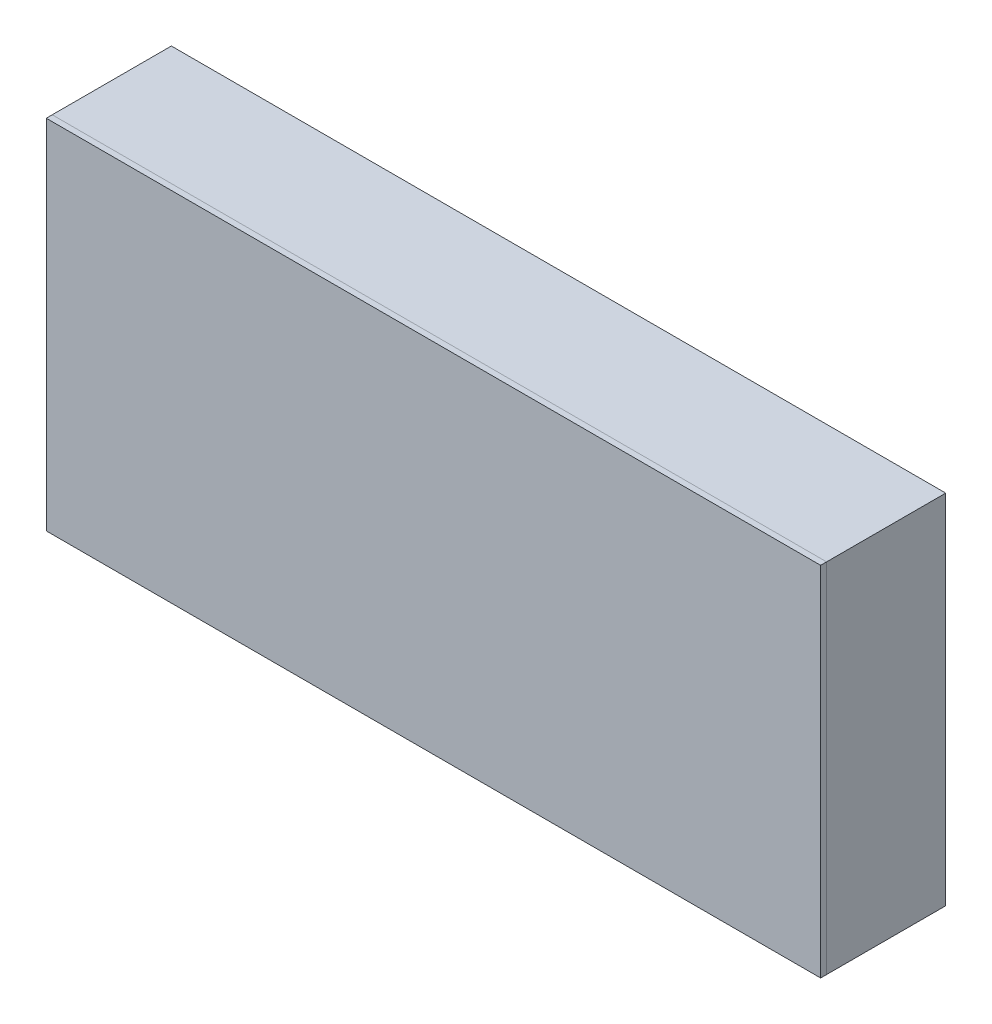
ISO-10303-21;
HEADER;
FILE_DESCRIPTION(('STEP AP214'),'2;1');
FILE_NAME('part.step','',(''),(''),'','','');
FILE_SCHEMA(('AUTOMOTIVE_DESIGN { 1 0 10303 214 1 1 1 1 }'));
ENDSEC;
DATA;
#1=APPLICATION_CONTEXT('core data for automotive mechanical design processes');
#2=APPLICATION_PROTOCOL_DEFINITION('international standard','automotive_design',2000,#1);
#3=PRODUCT_CONTEXT('',#1,'mechanical');
#4=PRODUCT('Part','Part','',(#3));
#5=PRODUCT_RELATED_PRODUCT_CATEGORY('part','',(#4));
#6=PRODUCT_DEFINITION_FORMATION('','',#4);
#7=PRODUCT_DEFINITION_CONTEXT('part definition',#1,'design');
#8=PRODUCT_DEFINITION('design','',#6,#7);
#9=PRODUCT_DEFINITION_SHAPE('','',#8);
#10=(LENGTH_UNIT() NAMED_UNIT(*) SI_UNIT(.MILLI.,.METRE.));
#11=(NAMED_UNIT(*) PLANE_ANGLE_UNIT() SI_UNIT($,.RADIAN.));
#12=(NAMED_UNIT(*) SI_UNIT($,.STERADIAN.) SOLID_ANGLE_UNIT());
#13=UNCERTAINTY_MEASURE_WITH_UNIT(LENGTH_MEASURE(1.E-05),#10,'distance_accuracy_value','');
#14=(GEOMETRIC_REPRESENTATION_CONTEXT(3) GLOBAL_UNCERTAINTY_ASSIGNED_CONTEXT((#13)) GLOBAL_UNIT_ASSIGNED_CONTEXT((#10,
#11,#12)) REPRESENTATION_CONTEXT('',''));
#15=CARTESIAN_POINT('',(0.,0.,0.));
#16=DIRECTION('',(0.,0.,1.));
#17=DIRECTION('',(1.,0.,0.));
#18=AXIS2_PLACEMENT_3D('',#15,#16,#17);
#19=CARTESIAN_POINT('',(0.,0.,20.));
#20=DIRECTION('',(0.,0.,1.));
#21=DIRECTION('',(1.,0.,0.));
#22=AXIS2_PLACEMENT_3D('',#19,#20,#21);
#23=PLANE('',#22);
#24=DIRECTION('',(0.,1.,0.));
#25=VECTOR('',#24,1.);
#26=CARTESIAN_POINT('',(65.,0.,20.));
#27=LINE('',#26,#25);
#28=CARTESIAN_POINT('',(65.,-30.,20.));
#29=VERTEX_POINT('',#28);
#30=CARTESIAN_POINT('',(65.,30.,20.));
#31=VERTEX_POINT('',#30);
#32=EDGE_CURVE('E230',#29,#31,#27,.T.);
#33=ORIENTED_EDGE('',*,*,#32,.F.);
#34=DIRECTION('',(1.,0.,0.));
#35=VECTOR('',#34,1.);
#36=CARTESIAN_POINT('',(0.,-30.,20.));
#37=LINE('',#36,#35);
#38=CARTESIAN_POINT('',(-65.,-30.,20.));
#39=VERTEX_POINT('',#38);
#40=EDGE_CURVE('E235',#39,#29,#37,.T.);
#41=ORIENTED_EDGE('',*,*,#40,.F.);
#42=DIRECTION('',(0.,-1.,0.));
#43=VECTOR('',#42,1.);
#44=CARTESIAN_POINT('',(-65.,0.,20.));
#45=LINE('',#44,#43);
#46=CARTESIAN_POINT('',(-65.,30.,20.));
#47=VERTEX_POINT('',#46);
#48=EDGE_CURVE('E246',#47,#39,#45,.T.);
#49=ORIENTED_EDGE('',*,*,#48,.F.);
#50=DIRECTION('',(-1.,0.,0.));
#51=VECTOR('',#50,1.);
#52=CARTESIAN_POINT('',(0.,30.,20.));
#53=LINE('',#52,#51);
#54=EDGE_CURVE('E244',#31,#47,#53,.T.);
#55=ORIENTED_EDGE('',*,*,#54,.F.);
#56=EDGE_LOOP('',(#33,#41,#49,#55));
#57=FACE_BOUND('',#56,.T.);
#58=DIRECTION('',(1.,0.,0.));
#59=VECTOR('',#58,1.);
#60=CARTESIAN_POINT('',(-62.75,27.75,20.));
#61=LINE('',#60,#59);
#62=CARTESIAN_POINT('',(-62.75,27.75,20.));
#63=VERTEX_POINT('',#62);
#64=CARTESIAN_POINT('',(62.75,27.75,20.));
#65=VERTEX_POINT('',#64);
#66=EDGE_CURVE('E179',#63,#65,#61,.T.);
#67=ORIENTED_EDGE('',*,*,#66,.F.);
#68=DIRECTION('',(0.,1.,0.));
#69=VECTOR('',#68,1.);
#70=CARTESIAN_POINT('',(-62.75,-27.75,20.));
#71=LINE('',#70,#69);
#72=CARTESIAN_POINT('',(-62.75,-27.75,20.));
#73=VERTEX_POINT('',#72);
#74=EDGE_CURVE('E207',#73,#63,#71,.T.);
#75=ORIENTED_EDGE('',*,*,#74,.F.);
#76=DIRECTION('',(-1.,0.,0.));
#77=VECTOR('',#76,1.);
#78=CARTESIAN_POINT('',(62.75,-27.75,20.));
#79=LINE('',#78,#77);
#80=CARTESIAN_POINT('',(62.75,-27.75,20.));
#81=VERTEX_POINT('',#80);
#82=EDGE_CURVE('E93',#81,#73,#79,.T.);
#83=ORIENTED_EDGE('',*,*,#82,.F.);
#84=DIRECTION('',(0.,-1.,0.));
#85=VECTOR('',#84,1.);
#86=CARTESIAN_POINT('',(62.75,27.75,20.));
#87=LINE('',#86,#85);
#88=EDGE_CURVE('E88',#65,#81,#87,.T.);
#89=ORIENTED_EDGE('',*,*,#88,.F.);
#90=EDGE_LOOP('',(#67,#75,#83,#89));
#91=FACE_BOUND('',#90,.T.);
#92=ADVANCED_FACE('F73',(#57,#91),#23,.F.);
#93=CARTESIAN_POINT('',(65.,0.,21.));
#94=DIRECTION('',(-1.,0.,0.));
#95=DIRECTION('',(0.,0.,1.));
#96=AXIS2_PLACEMENT_3D('',#93,#94,#95);
#97=PLANE('',#96);
#98=ORIENTED_EDGE('',*,*,#32,.T.);
#99=DIRECTION('',(0.,0.,-1.));
#100=VECTOR('',#99,1.);
#101=CARTESIAN_POINT('',(65.,30.,21.));
#102=LINE('',#101,#100);
#103=CARTESIAN_POINT('',(65.,30.,21.));
#104=VERTEX_POINT('',#103);
#105=EDGE_CURVE('E13',#104,#31,#102,.T.);
#106=ORIENTED_EDGE('',*,*,#105,.F.);
#107=DIRECTION('',(0.,1.,0.));
#108=VECTOR('',#107,1.);
#109=CARTESIAN_POINT('',(65.,0.,21.));
#110=LINE('',#109,#108);
#111=CARTESIAN_POINT('',(65.,-30.,21.));
#112=VERTEX_POINT('',#111);
#113=EDGE_CURVE('E231',#112,#104,#110,.T.);
#114=ORIENTED_EDGE('',*,*,#113,.F.);
#115=DIRECTION('',(0.,0.,-1.));
#116=VECTOR('',#115,1.);
#117=CARTESIAN_POINT('',(65.,-30.,21.));
#118=LINE('',#117,#116);
#119=EDGE_CURVE('E241',#112,#29,#118,.T.);
#120=ORIENTED_EDGE('',*,*,#119,.T.);
#121=EDGE_LOOP('',(#98,#106,#114,#120));
#122=FACE_BOUND('',#121,.T.);
#123=ADVANCED_FACE('F75',(#122),#97,.F.);
#124=CARTESIAN_POINT('',(0.,30.,21.));
#125=DIRECTION('',(0.,-1.,0.));
#126=DIRECTION('',(1.,0.,0.));
#127=AXIS2_PLACEMENT_3D('',#124,#125,#126);
#128=PLANE('',#127);
#129=ORIENTED_EDGE('',*,*,#54,.T.);
#130=DIRECTION('',(0.,0.,-1.));
#131=VECTOR('',#130,1.);
#132=CARTESIAN_POINT('',(-65.,30.,21.));
#133=LINE('',#132,#131);
#134=CARTESIAN_POINT('',(-65.,30.,21.));
#135=VERTEX_POINT('',#134);
#136=EDGE_CURVE('E81',#135,#47,#133,.T.);
#137=ORIENTED_EDGE('',*,*,#136,.F.);
#138=DIRECTION('',(-1.,0.,0.));
#139=VECTOR('',#138,1.);
#140=CARTESIAN_POINT('',(0.,30.,21.));
#141=LINE('',#140,#139);
#142=EDGE_CURVE('E234',#104,#135,#141,.T.);
#143=ORIENTED_EDGE('',*,*,#142,.F.);
#144=ORIENTED_EDGE('',*,*,#105,.T.);
#145=EDGE_LOOP('',(#129,#137,#143,#144));
#146=FACE_BOUND('',#145,.T.);
#147=ADVANCED_FACE('F273',(#146),#128,.F.);
#148=CARTESIAN_POINT('',(-65.,0.,21.));
#149=DIRECTION('',(1.,0.,0.));
#150=DIRECTION('',(0.,0.,-1.));
#151=AXIS2_PLACEMENT_3D('',#148,#149,#150);
#152=PLANE('',#151);
#153=ORIENTED_EDGE('',*,*,#48,.T.);
#154=DIRECTION('',(0.,0.,-1.));
#155=VECTOR('',#154,1.);
#156=CARTESIAN_POINT('',(-65.,-30.,21.));
#157=LINE('',#156,#155);
#158=CARTESIAN_POINT('',(-65.,-30.,21.));
#159=VERTEX_POINT('',#158);
#160=EDGE_CURVE('E251',#159,#39,#157,.T.);
#161=ORIENTED_EDGE('',*,*,#160,.F.);
#162=DIRECTION('',(0.,-1.,0.));
#163=VECTOR('',#162,1.);
#164=CARTESIAN_POINT('',(-65.,0.,21.));
#165=LINE('',#164,#163);
#166=EDGE_CURVE('E237',#135,#159,#165,.T.);
#167=ORIENTED_EDGE('',*,*,#166,.F.);
#168=ORIENTED_EDGE('',*,*,#136,.T.);
#169=EDGE_LOOP('',(#153,#161,#167,#168));
#170=FACE_BOUND('',#169,.T.);
#171=ADVANCED_FACE('F258',(#170),#152,.F.);
#172=CARTESIAN_POINT('',(0.,-30.,21.));
#173=DIRECTION('',(0.,1.,0.));
#174=DIRECTION('',(-1.,0.,0.));
#175=AXIS2_PLACEMENT_3D('',#172,#173,#174);
#176=PLANE('',#175);
#177=ORIENTED_EDGE('',*,*,#40,.T.);
#178=ORIENTED_EDGE('',*,*,#119,.F.);
#179=DIRECTION('',(1.,0.,0.));
#180=VECTOR('',#179,1.);
#181=CARTESIAN_POINT('',(0.,-30.,21.));
#182=LINE('',#181,#180);
#183=EDGE_CURVE('E239',#159,#112,#182,.T.);
#184=ORIENTED_EDGE('',*,*,#183,.F.);
#185=ORIENTED_EDGE('',*,*,#160,.T.);
#186=EDGE_LOOP('',(#177,#178,#184,#185));
#187=FACE_BOUND('',#186,.T.);
#188=ADVANCED_FACE('F266',(#187),#176,.F.);
#189=CARTESIAN_POINT('',(0.,0.,21.));
#190=DIRECTION('',(0.,0.,1.));
#191=DIRECTION('',(1.,0.,0.));
#192=AXIS2_PLACEMENT_3D('',#189,#190,#191);
#193=PLANE('',#192);
#194=ORIENTED_EDGE('',*,*,#113,.T.);
#195=ORIENTED_EDGE('',*,*,#142,.T.);
#196=ORIENTED_EDGE('',*,*,#166,.T.);
#197=ORIENTED_EDGE('',*,*,#183,.T.);
#198=EDGE_LOOP('',(#194,#195,#196,#197));
#199=FACE_BOUND('',#198,.T.);
#200=ADVANCED_FACE('F272',(#199),#193,.T.);
#201=CARTESIAN_POINT('',(0.,0.,15.));
#202=DIRECTION('',(0.,0.,-1.));
#203=DIRECTION('',(-1.,0.,0.));
#204=AXIS2_PLACEMENT_3D('',#201,#202,#203);
#205=PLANE('',#204);
#206=DIRECTION('',(1.,0.,0.));
#207=VECTOR('',#206,1.);
#208=CARTESIAN_POINT('',(-62.75,27.75,15.));
#209=LINE('',#208,#207);
#210=CARTESIAN_POINT('',(-62.75,27.75,15.));
#211=VERTEX_POINT('',#210);
#212=CARTESIAN_POINT('',(62.75,27.75,15.));
#213=VERTEX_POINT('',#212);
#214=EDGE_CURVE('E203',#211,#213,#209,.T.);
#215=ORIENTED_EDGE('',*,*,#214,.T.);
#216=DIRECTION('',(0.,-1.,0.));
#217=VECTOR('',#216,1.);
#218=CARTESIAN_POINT('',(62.75,27.75,15.));
#219=LINE('',#218,#217);
#220=CARTESIAN_POINT('',(62.75,-27.75,15.));
#221=VERTEX_POINT('',#220);
#222=EDGE_CURVE('E206',#213,#221,#219,.T.);
#223=ORIENTED_EDGE('',*,*,#222,.T.);
#224=DIRECTION('',(-1.,0.,0.));
#225=VECTOR('',#224,1.);
#226=CARTESIAN_POINT('',(62.75,-27.75,15.));
#227=LINE('',#226,#225);
#228=CARTESIAN_POINT('',(-62.75,-27.75,15.));
#229=VERTEX_POINT('',#228);
#230=EDGE_CURVE('E209',#221,#229,#227,.T.);
#231=ORIENTED_EDGE('',*,*,#230,.T.);
#232=DIRECTION('',(0.,1.,0.));
#233=VECTOR('',#232,1.);
#234=CARTESIAN_POINT('',(-62.75,-27.75,15.));
#235=LINE('',#234,#233);
#236=EDGE_CURVE('E211',#229,#211,#235,.T.);
#237=ORIENTED_EDGE('',*,*,#236,.T.);
#238=EDGE_LOOP('',(#215,#223,#231,#237));
#239=FACE_BOUND('',#238,.T.);
#240=DIRECTION('',(0.,-1.,0.));
#241=VECTOR('',#240,1.);
#242=CARTESIAN_POINT('',(60.75,0.,15.));
#243=LINE('',#242,#241);
#244=CARTESIAN_POINT('',(60.75,25.75,15.));
#245=VERTEX_POINT('',#244);
#246=CARTESIAN_POINT('',(60.75,-25.75,15.));
#247=VERTEX_POINT('',#246);
#248=EDGE_CURVE('E171',#245,#247,#243,.T.);
#249=ORIENTED_EDGE('',*,*,#248,.F.);
#250=DIRECTION('',(1.,0.,0.));
#251=VECTOR('',#250,1.);
#252=CARTESIAN_POINT('',(0.,25.75,15.));
#253=LINE('',#252,#251);
#254=CARTESIAN_POINT('',(-60.75,25.75,15.));
#255=VERTEX_POINT('',#254);
#256=EDGE_CURVE('E161',#255,#245,#253,.T.);
#257=ORIENTED_EDGE('',*,*,#256,.F.);
#258=DIRECTION('',(0.,1.,0.));
#259=VECTOR('',#258,1.);
#260=CARTESIAN_POINT('',(-60.75,0.,15.));
#261=LINE('',#260,#259);
#262=CARTESIAN_POINT('',(-60.75,-25.75,15.));
#263=VERTEX_POINT('',#262);
#264=EDGE_CURVE('E187',#263,#255,#261,.T.);
#265=ORIENTED_EDGE('',*,*,#264,.F.);
#266=DIRECTION('',(-1.,0.,0.));
#267=VECTOR('',#266,1.);
#268=CARTESIAN_POINT('',(0.,-25.75,15.));
#269=LINE('',#268,#267);
#270=EDGE_CURVE('E185',#247,#263,#269,.T.);
#271=ORIENTED_EDGE('',*,*,#270,.F.);
#272=EDGE_LOOP('',(#249,#257,#265,#271));
#273=FACE_BOUND('',#272,.T.);
#274=ADVANCED_FACE('F183',(#239,#273),#205,.T.);
#275=CARTESIAN_POINT('',(-62.75,27.75,15.));
#276=DIRECTION('',(0.,-1.,0.));
#277=DIRECTION('',(1.,0.,0.));
#278=AXIS2_PLACEMENT_3D('',#275,#276,#277);
#279=PLANE('',#278);
#280=ORIENTED_EDGE('',*,*,#66,.T.);
#281=DIRECTION('',(0.,0.,1.));
#282=VECTOR('',#281,1.);
#283=CARTESIAN_POINT('',(62.75,27.75,15.));
#284=LINE('',#283,#282);
#285=EDGE_CURVE('E228',#213,#65,#284,.T.);
#286=ORIENTED_EDGE('',*,*,#285,.F.);
#287=ORIENTED_EDGE('',*,*,#214,.F.);
#288=DIRECTION('',(0.,0.,1.));
#289=VECTOR('',#288,1.);
#290=CARTESIAN_POINT('',(-62.75,27.75,15.));
#291=LINE('',#290,#289);
#292=EDGE_CURVE('E213',#211,#63,#291,.T.);
#293=ORIENTED_EDGE('',*,*,#292,.T.);
#294=EDGE_LOOP('',(#280,#286,#287,#293));
#295=FACE_BOUND('',#294,.T.);
#296=ADVANCED_FACE('F311',(#295),#279,.F.);
#297=CARTESIAN_POINT('',(62.75,27.75,15.));
#298=DIRECTION('',(-1.,0.,0.));
#299=DIRECTION('',(0.,0.,1.));
#300=AXIS2_PLACEMENT_3D('',#297,#298,#299);
#301=PLANE('',#300);
#302=ORIENTED_EDGE('',*,*,#88,.T.);
#303=DIRECTION('',(0.,0.,1.));
#304=VECTOR('',#303,1.);
#305=CARTESIAN_POINT('',(62.75,-27.75,15.));
#306=LINE('',#305,#304);
#307=EDGE_CURVE('E225',#221,#81,#306,.T.);
#308=ORIENTED_EDGE('',*,*,#307,.F.);
#309=ORIENTED_EDGE('',*,*,#222,.F.);
#310=ORIENTED_EDGE('',*,*,#285,.T.);
#311=EDGE_LOOP('',(#302,#308,#309,#310));
#312=FACE_BOUND('',#311,.T.);
#313=ADVANCED_FACE('F319',(#312),#301,.F.);
#314=CARTESIAN_POINT('',(62.75,-27.75,15.));
#315=DIRECTION('',(0.,1.,0.));
#316=DIRECTION('',(-1.,0.,0.));
#317=AXIS2_PLACEMENT_3D('',#314,#315,#316);
#318=PLANE('',#317);
#319=ORIENTED_EDGE('',*,*,#82,.T.);
#320=DIRECTION('',(0.,0.,1.));
#321=VECTOR('',#320,1.);
#322=CARTESIAN_POINT('',(-62.75,-27.75,15.));
#323=LINE('',#322,#321);
#324=EDGE_CURVE('E222',#229,#73,#323,.T.);
#325=ORIENTED_EDGE('',*,*,#324,.F.);
#326=ORIENTED_EDGE('',*,*,#230,.F.);
#327=ORIENTED_EDGE('',*,*,#307,.T.);
#328=EDGE_LOOP('',(#319,#325,#326,#327));
#329=FACE_BOUND('',#328,.T.);
#330=ADVANCED_FACE('F315',(#329),#318,.F.);
#331=CARTESIAN_POINT('',(-62.75,-27.75,15.));
#332=DIRECTION('',(1.,0.,0.));
#333=DIRECTION('',(0.,0.,-1.));
#334=AXIS2_PLACEMENT_3D('',#331,#332,#333);
#335=PLANE('',#334);
#336=ORIENTED_EDGE('',*,*,#74,.T.);
#337=ORIENTED_EDGE('',*,*,#292,.F.);
#338=ORIENTED_EDGE('',*,*,#236,.F.);
#339=ORIENTED_EDGE('',*,*,#324,.T.);
#340=EDGE_LOOP('',(#336,#337,#338,#339));
#341=FACE_BOUND('',#340,.T.);
#342=ADVANCED_FACE('F308',(#341),#335,.F.);
#343=CARTESIAN_POINT('',(0.,25.75,15.));
#344=DIRECTION('',(0.,-1.,0.));
#345=DIRECTION('',(1.,0.,0.));
#346=AXIS2_PLACEMENT_3D('',#343,#344,#345);
#347=PLANE('',#346);
#348=DIRECTION('',(1.,0.,0.));
#349=VECTOR('',#348,1.);
#350=CARTESIAN_POINT('',(0.,25.75,20.));
#351=LINE('',#350,#349);
#352=CARTESIAN_POINT('',(-60.75,25.75,20.));
#353=VERTEX_POINT('',#352);
#354=CARTESIAN_POINT('',(60.75,25.75,20.));
#355=VERTEX_POINT('',#354);
#356=EDGE_CURVE('E191',#353,#355,#351,.T.);
#357=ORIENTED_EDGE('',*,*,#356,.F.);
#358=DIRECTION('',(0.,0.,1.));
#359=VECTOR('',#358,1.);
#360=CARTESIAN_POINT('',(-60.75,25.75,15.));
#361=LINE('',#360,#359);
#362=EDGE_CURVE('E167',#255,#353,#361,.T.);
#363=ORIENTED_EDGE('',*,*,#362,.F.);
#364=ORIENTED_EDGE('',*,*,#256,.T.);
#365=DIRECTION('',(0.,0.,1.));
#366=VECTOR('',#365,1.);
#367=CARTESIAN_POINT('',(60.75,25.75,15.));
#368=LINE('',#367,#366);
#369=EDGE_CURVE('E165',#245,#355,#368,.T.);
#370=ORIENTED_EDGE('',*,*,#369,.T.);
#371=EDGE_LOOP('',(#357,#363,#364,#370));
#372=FACE_BOUND('',#371,.T.);
#373=ADVANCED_FACE('F164',(#372),#347,.T.);
#374=CARTESIAN_POINT('',(60.75,0.,15.));
#375=DIRECTION('',(-1.,0.,0.));
#376=DIRECTION('',(0.,0.,1.));
#377=AXIS2_PLACEMENT_3D('',#374,#375,#376);
#378=PLANE('',#377);
#379=DIRECTION('',(0.,-1.,0.));
#380=VECTOR('',#379,1.);
#381=CARTESIAN_POINT('',(60.75,0.,20.));
#382=LINE('',#381,#380);
#383=CARTESIAN_POINT('',(60.75,-25.75,20.));
#384=VERTEX_POINT('',#383);
#385=EDGE_CURVE('E178',#355,#384,#382,.T.);
#386=ORIENTED_EDGE('',*,*,#385,.F.);
#387=ORIENTED_EDGE('',*,*,#369,.F.);
#388=ORIENTED_EDGE('',*,*,#248,.T.);
#389=DIRECTION('',(0.,0.,1.));
#390=VECTOR('',#389,1.);
#391=CARTESIAN_POINT('',(60.75,-25.75,15.));
#392=LINE('',#391,#390);
#393=EDGE_CURVE('E180',#247,#384,#392,.T.);
#394=ORIENTED_EDGE('',*,*,#393,.T.);
#395=EDGE_LOOP('',(#386,#387,#388,#394));
#396=FACE_BOUND('',#395,.T.);
#397=ADVANCED_FACE('F175',(#396),#378,.T.);
#398=CARTESIAN_POINT('',(0.,-25.75,15.));
#399=DIRECTION('',(0.,1.,0.));
#400=DIRECTION('',(-1.,0.,0.));
#401=AXIS2_PLACEMENT_3D('',#398,#399,#400);
#402=PLANE('',#401);
#403=DIRECTION('',(-1.,0.,0.));
#404=VECTOR('',#403,1.);
#405=CARTESIAN_POINT('',(0.,-25.75,20.));
#406=LINE('',#405,#404);
#407=CARTESIAN_POINT('',(-60.75,-25.75,20.));
#408=VERTEX_POINT('',#407);
#409=EDGE_CURVE('E194',#384,#408,#406,.T.);
#410=ORIENTED_EDGE('',*,*,#409,.F.);
#411=ORIENTED_EDGE('',*,*,#393,.F.);
#412=ORIENTED_EDGE('',*,*,#270,.T.);
#413=DIRECTION('',(0.,0.,1.));
#414=VECTOR('',#413,1.);
#415=CARTESIAN_POINT('',(-60.75,-25.75,15.));
#416=LINE('',#415,#414);
#417=EDGE_CURVE('E200',#263,#408,#416,.T.);
#418=ORIENTED_EDGE('',*,*,#417,.T.);
#419=EDGE_LOOP('',(#410,#411,#412,#418));
#420=FACE_BOUND('',#419,.T.);
#421=ADVANCED_FACE('F293',(#420),#402,.T.);
#422=CARTESIAN_POINT('',(-60.75,0.,15.));
#423=DIRECTION('',(1.,0.,0.));
#424=DIRECTION('',(0.,0.,-1.));
#425=AXIS2_PLACEMENT_3D('',#422,#423,#424);
#426=PLANE('',#425);
#427=DIRECTION('',(0.,1.,0.));
#428=VECTOR('',#427,1.);
#429=CARTESIAN_POINT('',(-60.75,0.,20.));
#430=LINE('',#429,#428);
#431=EDGE_CURVE('E172',#408,#353,#430,.T.);
#432=ORIENTED_EDGE('',*,*,#431,.F.);
#433=ORIENTED_EDGE('',*,*,#417,.F.);
#434=ORIENTED_EDGE('',*,*,#264,.T.);
#435=ORIENTED_EDGE('',*,*,#362,.T.);
#436=EDGE_LOOP('',(#432,#433,#434,#435));
#437=FACE_BOUND('',#436,.T.);
#438=ADVANCED_FACE('F288',(#437),#426,.T.);
#439=ORIENTED_EDGE('',*,*,#431,.T.);
#440=ORIENTED_EDGE('',*,*,#356,.T.);
#441=ORIENTED_EDGE('',*,*,#385,.T.);
#442=ORIENTED_EDGE('',*,*,#409,.T.);
#443=EDGE_LOOP('',(#439,#440,#441,#442));
#444=FACE_BOUND('',#443,.T.);
#445=ADVANCED_FACE('F282',(#444),#23,.F.);
#446=CLOSED_SHELL('',(#92,#123,#147,#171,#188,#200,#274,#296,#313,#330,#342,#373,#397,#421,#438,#445));
#447=MANIFOLD_SOLID_BREP('B2',#446);
#448=CARTESIAN_POINT('',(-63.,30.,20.));
#449=DIRECTION('',(-1.,0.,0.));
#450=DIRECTION('',(0.,0.,1.));
#451=AXIS2_PLACEMENT_3D('',#448,#449,#450);
#452=PLANE('',#451);
#453=DIRECTION('',(0.,0.707106781186549,-0.707106781186546));
#454=VECTOR('',#453,1.);
#455=CARTESIAN_POINT('',(-63.,6.00036401427941,14.));
#456=LINE('',#455,#454);
#457=CARTESIAN_POINT('',(-63.,6.00036401427941,14.));
#458=VERTEX_POINT('',#457);
#459=CARTESIAN_POINT('',(-63.,8.00036401427942,12.));
#460=VERTEX_POINT('',#459);
#461=EDGE_CURVE('E576',#458,#460,#456,.T.);
#462=ORIENTED_EDGE('',*,*,#461,.T.);
#463=DIRECTION('',(0.,0.,-1.));
#464=VECTOR('',#463,1.);
#465=CARTESIAN_POINT('',(-63.,8.00036401427942,20.));
#466=LINE('',#465,#464);
#467=CARTESIAN_POINT('',(-63.,8.00036401427942,1.));
#468=VERTEX_POINT('',#467);
#469=EDGE_CURVE('E453',#460,#468,#466,.T.);
#470=ORIENTED_EDGE('',*,*,#469,.T.);
#471=DIRECTION('',(0.,-1.,0.));
#472=VECTOR('',#471,1.);
#473=CARTESIAN_POINT('',(-63.,30.,1.));
#474=LINE('',#473,#472);
#475=CARTESIAN_POINT('',(-63.,28.,1.));
#476=VERTEX_POINT('',#475);
#477=EDGE_CURVE('E657',#476,#468,#474,.T.);
#478=ORIENTED_EDGE('',*,*,#477,.F.);
#479=DIRECTION('',(0.,0.,-1.));
#480=VECTOR('',#479,1.);
#481=CARTESIAN_POINT('',(-63.,28.,20.));
#482=LINE('',#481,#480);
#483=CARTESIAN_POINT('',(-63.,28.,20.));
#484=VERTEX_POINT('',#483);
#485=EDGE_CURVE('E711',#484,#476,#482,.T.);
#486=ORIENTED_EDGE('',*,*,#485,.F.);
#487=DIRECTION('',(0.,1.,0.));
#488=VECTOR('',#487,1.);
#489=CARTESIAN_POINT('',(-63.,-30.,20.));
#490=LINE('',#489,#488);
#491=CARTESIAN_POINT('',(-63.,-28.,20.));
#492=VERTEX_POINT('',#491);
#493=EDGE_CURVE('E664',#492,#484,#490,.T.);
#494=ORIENTED_EDGE('',*,*,#493,.F.);
#495=DIRECTION('',(0.,0.,-1.));
#496=VECTOR('',#495,1.);
#497=CARTESIAN_POINT('',(-63.,-28.,20.));
#498=LINE('',#497,#496);
#499=CARTESIAN_POINT('',(-63.,-28.,1.));
#500=VERTEX_POINT('',#499);
#501=EDGE_CURVE('E684',#492,#500,#498,.T.);
#502=ORIENTED_EDGE('',*,*,#501,.T.);
#503=DIRECTION('',(0.,-1.,0.));
#504=VECTOR('',#503,1.);
#505=CARTESIAN_POINT('',(-63.,-30.,1.));
#506=LINE('',#505,#504);
#507=CARTESIAN_POINT('',(-63.,-8.99963598572058,1.));
#508=VERTEX_POINT('',#507);
#509=EDGE_CURVE('E660',#508,#500,#506,.T.);
#510=ORIENTED_EDGE('',*,*,#509,.F.);
#511=DIRECTION('',(0.,0.,-1.));
#512=VECTOR('',#511,1.);
#513=CARTESIAN_POINT('',(-63.,-8.99963598572058,20.));
#514=LINE('',#513,#512);
#515=CARTESIAN_POINT('',(-63.,-8.99963598572058,12.));
#516=VERTEX_POINT('',#515);
#517=EDGE_CURVE('E446',#516,#508,#514,.T.);
#518=ORIENTED_EDGE('',*,*,#517,.F.);
#519=DIRECTION('',(0.,0.707106781186549,0.707106781186546));
#520=VECTOR('',#519,1.);
#521=CARTESIAN_POINT('',(-63.,-6.99963598572057,14.));
#522=LINE('',#521,#520);
#523=CARTESIAN_POINT('',(-63.,-6.99963598572057,14.));
#524=VERTEX_POINT('',#523);
#525=EDGE_CURVE('E578',#516,#524,#522,.T.);
#526=ORIENTED_EDGE('',*,*,#525,.T.);
#527=DIRECTION('',(0.,1.,0.));
#528=VECTOR('',#527,1.);
#529=CARTESIAN_POINT('',(-63.,8.00036401427942,14.));
#530=LINE('',#529,#528);
#531=EDGE_CURVE('E573',#458,#524,#530,.F.);
#532=ORIENTED_EDGE('',*,*,#531,.F.);
#533=EDGE_LOOP('',(#462,#470,#478,#486,#494,#502,#510,#518,#526,#532));
#534=FACE_BOUND('',#533,.T.);
#535=ADVANCED_FACE('F438',(#534),#452,.F.);
#536=CARTESIAN_POINT('',(65.,28.,20.));
#537=DIRECTION('',(0.,1.,0.));
#538=DIRECTION('',(-1.,0.,0.));
#539=AXIS2_PLACEMENT_3D('',#536,#537,#538);
#540=PLANE('',#539);
#541=DIRECTION('',(-1.,0.,0.));
#542=VECTOR('',#541,1.);
#543=CARTESIAN_POINT('',(65.,28.,1.));
#544=LINE('',#543,#542);
#545=CARTESIAN_POINT('',(63.,28.,1.));
#546=VERTEX_POINT('',#545);
#547=EDGE_CURVE('E654',#546,#476,#544,.T.);
#548=ORIENTED_EDGE('',*,*,#547,.F.);
#549=DIRECTION('',(0.,0.,-1.));
#550=VECTOR('',#549,1.);
#551=CARTESIAN_POINT('',(63.,28.,20.));
#552=LINE('',#551,#550);
#553=CARTESIAN_POINT('',(63.,28.,20.));
#554=VERTEX_POINT('',#553);
#555=EDGE_CURVE('E708',#554,#546,#552,.T.);
#556=ORIENTED_EDGE('',*,*,#555,.F.);
#557=DIRECTION('',(1.,0.,0.));
#558=VECTOR('',#557,1.);
#559=CARTESIAN_POINT('',(65.,28.,20.));
#560=LINE('',#559,#558);
#561=EDGE_CURVE('E678',#484,#554,#560,.T.);
#562=ORIENTED_EDGE('',*,*,#561,.F.);
#563=ORIENTED_EDGE('',*,*,#485,.T.);
#564=EDGE_LOOP('',(#548,#556,#562,#563));
#565=FACE_BOUND('',#564,.T.);
#566=ADVANCED_FACE('F765',(#565),#540,.F.);
#567=CARTESIAN_POINT('',(63.,-30.,20.));
#568=DIRECTION('',(1.,0.,0.));
#569=DIRECTION('',(0.,0.,-1.));
#570=AXIS2_PLACEMENT_3D('',#567,#568,#569);
#571=PLANE('',#570);
#572=DIRECTION('',(0.,1.,0.));
#573=VECTOR('',#572,1.);
#574=CARTESIAN_POINT('',(63.,-30.,1.));
#575=LINE('',#574,#573);
#576=CARTESIAN_POINT('',(63.,-28.,1.));
#577=VERTEX_POINT('',#576);
#578=EDGE_CURVE('E651',#577,#546,#575,.T.);
#579=ORIENTED_EDGE('',*,*,#578,.F.);
#580=DIRECTION('',(0.,0.,-1.));
#581=VECTOR('',#580,1.);
#582=CARTESIAN_POINT('',(63.,-28.,20.));
#583=LINE('',#582,#581);
#584=CARTESIAN_POINT('',(63.,-28.,20.));
#585=VERTEX_POINT('',#584);
#586=EDGE_CURVE('E705',#585,#577,#583,.T.);
#587=ORIENTED_EDGE('',*,*,#586,.F.);
#588=DIRECTION('',(0.,1.,0.));
#589=VECTOR('',#588,1.);
#590=CARTESIAN_POINT('',(63.,-30.,20.));
#591=LINE('',#590,#589);
#592=EDGE_CURVE('E680',#554,#585,#591,.F.);
#593=ORIENTED_EDGE('',*,*,#592,.F.);
#594=ORIENTED_EDGE('',*,*,#555,.T.);
#595=EDGE_LOOP('',(#579,#587,#593,#594));
#596=FACE_BOUND('',#595,.T.);
#597=ADVANCED_FACE('F770',(#596),#571,.F.);
#598=CARTESIAN_POINT('',(65.,-28.,20.));
#599=DIRECTION('',(0.,-1.,0.));
#600=DIRECTION('',(1.,0.,0.));
#601=AXIS2_PLACEMENT_3D('',#598,#599,#600);
#602=PLANE('',#601);
#603=DIRECTION('',(1.,0.,0.));
#604=VECTOR('',#603,1.);
#605=CARTESIAN_POINT('',(65.,-28.,1.));
#606=LINE('',#605,#604);
#607=EDGE_CURVE('E71',#500,#577,#606,.T.);
#608=ORIENTED_EDGE('',*,*,#607,.F.);
#609=ORIENTED_EDGE('',*,*,#501,.F.);
#610=DIRECTION('',(-1.,0.,0.));
#611=VECTOR('',#610,1.);
#612=CARTESIAN_POINT('',(65.,-28.,20.));
#613=LINE('',#612,#611);
#614=EDGE_CURVE('E682',#585,#492,#613,.T.);
#615=ORIENTED_EDGE('',*,*,#614,.F.);
#616=ORIENTED_EDGE('',*,*,#586,.T.);
#617=EDGE_LOOP('',(#608,#609,#615,#616));
#618=FACE_BOUND('',#617,.T.);
#619=ADVANCED_FACE('F794',(#618),#602,.F.);
#620=CARTESIAN_POINT('',(-65.,-8.99963598572058,20.));
#621=DIRECTION('',(0.,1.,0.));
#622=DIRECTION('',(0.,0.,1.));
#623=AXIS2_PLACEMENT_3D('',#620,#621,#622);
#624=PLANE('',#623);
#625=DIRECTION('',(1.,0.,0.));
#626=VECTOR('',#625,1.);
#627=CARTESIAN_POINT('',(-65.,-8.99963598572058,12.));
#628=LINE('',#627,#626);
#629=CARTESIAN_POINT('',(-65.,-8.99963598572058,12.));
#630=VERTEX_POINT('',#629);
#631=EDGE_CURVE('E601',#630,#516,#628,.T.);
#632=ORIENTED_EDGE('',*,*,#631,.T.);
#633=ORIENTED_EDGE('',*,*,#517,.T.);
#634=DIRECTION('',(1.,0.,0.));
#635=VECTOR('',#634,1.);
#636=CARTESIAN_POINT('',(-65.,-8.99963598572058,1.));
#637=LINE('',#636,#635);
#638=CARTESIAN_POINT('',(-53.,-8.99963598572058,1.));
#639=VERTEX_POINT('',#638);
#640=EDGE_CURVE('E611',#508,#639,#637,.T.);
#641=ORIENTED_EDGE('',*,*,#640,.T.);
#642=DIRECTION('',(0.,0.,-1.));
#643=VECTOR('',#642,1.);
#644=CARTESIAN_POINT('',(-53.,-8.99963598572058,1.));
#645=LINE('',#644,#643);
#646=CARTESIAN_POINT('',(-53.,-8.99963598572058,0.));
#647=VERTEX_POINT('',#646);
#648=EDGE_CURVE('E648',#639,#647,#645,.T.);
#649=ORIENTED_EDGE('',*,*,#648,.T.);
#650=DIRECTION('',(1.,0.,0.));
#651=VECTOR('',#650,1.);
#652=CARTESIAN_POINT('',(-65.,-8.99963598572058,0.));
#653=LINE('',#652,#651);
#654=CARTESIAN_POINT('',(-65.,-8.99963598572058,0.));
#655=VERTEX_POINT('',#654);
#656=EDGE_CURVE('E663',#655,#647,#653,.T.);
#657=ORIENTED_EDGE('',*,*,#656,.F.);
#658=DIRECTION('',(0.,0.,-1.));
#659=VECTOR('',#658,1.);
#660=CARTESIAN_POINT('',(-65.,-8.99963598572058,20.));
#661=LINE('',#660,#659);
#662=EDGE_CURVE('E725',#630,#655,#661,.T.);
#663=ORIENTED_EDGE('',*,*,#662,.F.);
#664=EDGE_LOOP('',(#632,#633,#641,#649,#657,#663));
#665=FACE_BOUND('',#664,.T.);
#666=ADVANCED_FACE('F440',(#665),#624,.T.);
#667=CARTESIAN_POINT('',(65.,-30.,20.));
#668=DIRECTION('',(0.,-1.,0.));
#669=DIRECTION('',(1.,0.,0.));
#670=AXIS2_PLACEMENT_3D('',#667,#668,#669);
#671=PLANE('',#670);
#672=DIRECTION('',(-1.,0.,0.));
#673=VECTOR('',#672,1.);
#674=CARTESIAN_POINT('',(65.,-30.,0.));
#675=LINE('',#674,#673);
#676=CARTESIAN_POINT('',(65.,-30.,0.));
#677=VERTEX_POINT('',#676);
#678=CARTESIAN_POINT('',(-65.,-30.,0.));
#679=VERTEX_POINT('',#678);
#680=EDGE_CURVE('E689',#677,#679,#675,.T.);
#681=ORIENTED_EDGE('',*,*,#680,.F.);
#682=DIRECTION('',(0.,0.,-1.));
#683=VECTOR('',#682,1.);
#684=CARTESIAN_POINT('',(65.,-30.,20.));
#685=LINE('',#684,#683);
#686=CARTESIAN_POINT('',(65.,-30.,20.));
#687=VERTEX_POINT('',#686);
#688=EDGE_CURVE('E721',#687,#677,#685,.T.);
#689=ORIENTED_EDGE('',*,*,#688,.F.);
#690=DIRECTION('',(-1.,0.,0.));
#691=VECTOR('',#690,1.);
#692=CARTESIAN_POINT('',(65.,-30.,20.));
#693=LINE('',#692,#691);
#694=CARTESIAN_POINT('',(-65.,-30.,20.));
#695=VERTEX_POINT('',#694);
#696=EDGE_CURVE('E669',#687,#695,#693,.T.);
#697=ORIENTED_EDGE('',*,*,#696,.T.);
#698=DIRECTION('',(0.,0.,-1.));
#699=VECTOR('',#698,1.);
#700=CARTESIAN_POINT('',(-65.,-30.,20.));
#701=LINE('',#700,#699);
#702=EDGE_CURVE('E723',#695,#679,#701,.T.);
#703=ORIENTED_EDGE('',*,*,#702,.T.);
#704=EDGE_LOOP('',(#681,#689,#697,#703));
#705=FACE_BOUND('',#704,.T.);
#706=ADVANCED_FACE('F787',(#705),#671,.T.);
#707=CARTESIAN_POINT('',(65.,-30.,20.));
#708=DIRECTION('',(1.,0.,0.));
#709=DIRECTION('',(0.,0.,-1.));
#710=AXIS2_PLACEMENT_3D('',#707,#708,#709);
#711=PLANE('',#710);
#712=DIRECTION('',(0.,-1.,0.));
#713=VECTOR('',#712,1.);
#714=CARTESIAN_POINT('',(65.,-30.,0.));
#715=LINE('',#714,#713);
#716=CARTESIAN_POINT('',(65.,30.,0.));
#717=VERTEX_POINT('',#716);
#718=EDGE_CURVE('E692',#717,#677,#715,.T.);
#719=ORIENTED_EDGE('',*,*,#718,.F.);
#720=DIRECTION('',(0.,0.,-1.));
#721=VECTOR('',#720,1.);
#722=CARTESIAN_POINT('',(65.,30.,20.));
#723=LINE('',#722,#721);
#724=CARTESIAN_POINT('',(65.,30.,20.));
#725=VERTEX_POINT('',#724);
#726=EDGE_CURVE('E719',#725,#717,#723,.T.);
#727=ORIENTED_EDGE('',*,*,#726,.F.);
#728=DIRECTION('',(0.,-1.,0.));
#729=VECTOR('',#728,1.);
#730=CARTESIAN_POINT('',(65.,-30.,20.));
#731=LINE('',#730,#729);
#732=EDGE_CURVE('E672',#725,#687,#731,.T.);
#733=ORIENTED_EDGE('',*,*,#732,.T.);
#734=ORIENTED_EDGE('',*,*,#688,.T.);
#735=EDGE_LOOP('',(#719,#727,#733,#734));
#736=FACE_BOUND('',#735,.T.);
#737=ADVANCED_FACE('F784',(#736),#711,.T.);
#738=CARTESIAN_POINT('',(65.,30.,20.));
#739=DIRECTION('',(0.,1.,0.));
#740=DIRECTION('',(-1.,0.,0.));
#741=AXIS2_PLACEMENT_3D('',#738,#739,#740);
#742=PLANE('',#741);
#743=DIRECTION('',(1.,0.,0.));
#744=VECTOR('',#743,1.);
#745=CARTESIAN_POINT('',(65.,30.,0.));
#746=LINE('',#745,#744);
#747=CARTESIAN_POINT('',(-65.,30.,0.));
#748=VERTEX_POINT('',#747);
#749=EDGE_CURVE('E695',#748,#717,#746,.T.);
#750=ORIENTED_EDGE('',*,*,#749,.F.);
#751=DIRECTION('',(0.,0.,-1.));
#752=VECTOR('',#751,1.);
#753=CARTESIAN_POINT('',(-65.,30.,20.));
#754=LINE('',#753,#752);
#755=CARTESIAN_POINT('',(-65.,30.,20.));
#756=VERTEX_POINT('',#755);
#757=EDGE_CURVE('E717',#756,#748,#754,.T.);
#758=ORIENTED_EDGE('',*,*,#757,.F.);
#759=DIRECTION('',(1.,0.,0.));
#760=VECTOR('',#759,1.);
#761=CARTESIAN_POINT('',(65.,30.,20.));
#762=LINE('',#761,#760);
#763=EDGE_CURVE('E675',#756,#725,#762,.T.);
#764=ORIENTED_EDGE('',*,*,#763,.T.);
#765=ORIENTED_EDGE('',*,*,#726,.T.);
#766=EDGE_LOOP('',(#750,#758,#764,#765));
#767=FACE_BOUND('',#766,.T.);
#768=ADVANCED_FACE('F781',(#767),#742,.T.);
#769=CARTESIAN_POINT('',(-65.,30.,20.));
#770=DIRECTION('',(-1.,0.,0.));
#771=DIRECTION('',(0.,0.,1.));
#772=AXIS2_PLACEMENT_3D('',#769,#770,#771);
#773=PLANE('',#772);
#774=DIRECTION('',(0.,0.,-1.));
#775=VECTOR('',#774,1.);
#776=CARTESIAN_POINT('',(-65.,8.00036401427942,20.));
#777=LINE('',#776,#775);
#778=CARTESIAN_POINT('',(-65.,8.00036401427942,12.));
#779=VERTEX_POINT('',#778);
#780=CARTESIAN_POINT('',(-65.,8.00036401427942,0.));
#781=VERTEX_POINT('',#780);
#782=EDGE_CURVE('E715',#779,#781,#777,.T.);
#783=ORIENTED_EDGE('',*,*,#782,.F.);
#784=DIRECTION('',(0.,0.707106781186549,-0.707106781186546));
#785=VECTOR('',#784,1.);
#786=CARTESIAN_POINT('',(-65.,6.00036401427941,14.));
#787=LINE('',#786,#785);
#788=CARTESIAN_POINT('',(-65.,6.00036401427941,14.));
#789=VERTEX_POINT('',#788);
#790=EDGE_CURVE('E590',#789,#779,#787,.T.);
#791=ORIENTED_EDGE('',*,*,#790,.F.);
#792=DIRECTION('',(0.,-1.,0.));
#793=VECTOR('',#792,1.);
#794=CARTESIAN_POINT('',(-65.,8.00036401427942,14.));
#795=LINE('',#794,#793);
#796=CARTESIAN_POINT('',(-65.,-6.99963598572057,14.));
#797=VERTEX_POINT('',#796);
#798=EDGE_CURVE('E582',#789,#797,#795,.T.);
#799=ORIENTED_EDGE('',*,*,#798,.T.);
#800=DIRECTION('',(0.,0.707106781186549,0.707106781186546));
#801=VECTOR('',#800,1.);
#802=CARTESIAN_POINT('',(-65.,-6.99963598572057,14.));
#803=LINE('',#802,#801);
#804=EDGE_CURVE('E598',#630,#797,#803,.T.);
#805=ORIENTED_EDGE('',*,*,#804,.F.);
#806=ORIENTED_EDGE('',*,*,#662,.T.);
#807=DIRECTION('',(0.,1.,0.));
#808=VECTOR('',#807,1.);
#809=CARTESIAN_POINT('',(-65.,-30.,0.));
#810=LINE('',#809,#808);
#811=EDGE_CURVE('E686',#679,#655,#810,.T.);
#812=ORIENTED_EDGE('',*,*,#811,.F.);
#813=ORIENTED_EDGE('',*,*,#702,.F.);
#814=DIRECTION('',(0.,1.,0.));
#815=VECTOR('',#814,1.);
#816=CARTESIAN_POINT('',(-65.,-30.,20.));
#817=LINE('',#816,#815);
#818=EDGE_CURVE('E666',#695,#756,#817,.T.);
#819=ORIENTED_EDGE('',*,*,#818,.T.);
#820=ORIENTED_EDGE('',*,*,#757,.T.);
#821=DIRECTION('',(0.,1.,0.));
#822=VECTOR('',#821,1.);
#823=CARTESIAN_POINT('',(-65.,30.,0.));
#824=LINE('',#823,#822);
#825=EDGE_CURVE('E698',#781,#748,#824,.T.);
#826=ORIENTED_EDGE('',*,*,#825,.F.);
#827=EDGE_LOOP('',(#783,#791,#799,#805,#806,#812,#813,#819,#820,#826));
#828=FACE_BOUND('',#827,.T.);
#829=ADVANCED_FACE('F748',(#828),#773,.T.);
#830=CARTESIAN_POINT('',(-63.,8.00036401427942,20.));
#831=DIRECTION('',(0.,-1.,0.));
#832=DIRECTION('',(0.,0.,-1.));
#833=AXIS2_PLACEMENT_3D('',#830,#831,#832);
#834=PLANE('',#833);
#835=DIRECTION('',(1.,0.,0.));
#836=VECTOR('',#835,1.);
#837=CARTESIAN_POINT('',(-65.,8.00036401427942,12.));
#838=LINE('',#837,#836);
#839=EDGE_CURVE('E457',#779,#460,#838,.T.);
#840=ORIENTED_EDGE('',*,*,#839,.F.);
#841=ORIENTED_EDGE('',*,*,#782,.T.);
#842=DIRECTION('',(-1.,0.,0.));
#843=VECTOR('',#842,1.);
#844=CARTESIAN_POINT('',(-63.,8.00036401427942,0.));
#845=LINE('',#844,#843);
#846=CARTESIAN_POINT('',(-53.,8.00036401427942,0.));
#847=VERTEX_POINT('',#846);
#848=EDGE_CURVE('E667',#847,#781,#845,.T.);
#849=ORIENTED_EDGE('',*,*,#848,.F.);
#850=DIRECTION('',(0.,0.,-1.));
#851=VECTOR('',#850,1.);
#852=CARTESIAN_POINT('',(-53.,8.00036401427942,1.));
#853=LINE('',#852,#851);
#854=CARTESIAN_POINT('',(-53.,8.00036401427942,1.));
#855=VERTEX_POINT('',#854);
#856=EDGE_CURVE('E645',#855,#847,#853,.T.);
#857=ORIENTED_EDGE('',*,*,#856,.F.);
#858=DIRECTION('',(-1.,0.,0.));
#859=VECTOR('',#858,1.);
#860=CARTESIAN_POINT('',(-53.,8.00036401427942,1.));
#861=LINE('',#860,#859);
#862=EDGE_CURVE('E614',#855,#468,#861,.T.);
#863=ORIENTED_EDGE('',*,*,#862,.T.);
#864=ORIENTED_EDGE('',*,*,#469,.F.);
#865=EDGE_LOOP('',(#840,#841,#849,#857,#863,#864));
#866=FACE_BOUND('',#865,.T.);
#867=ADVANCED_FACE('F775',(#866),#834,.T.);
#868=CARTESIAN_POINT('',(0.,0.,20.));
#869=DIRECTION('',(0.,0.,-1.));
#870=DIRECTION('',(-1.,0.,0.));
#871=AXIS2_PLACEMENT_3D('',#868,#869,#870);
#872=PLANE('',#871);
#873=ORIENTED_EDGE('',*,*,#493,.T.);
#874=ORIENTED_EDGE('',*,*,#561,.T.);
#875=ORIENTED_EDGE('',*,*,#592,.T.);
#876=ORIENTED_EDGE('',*,*,#614,.T.);
#877=EDGE_LOOP('',(#873,#874,#875,#876));
#878=FACE_BOUND('',#877,.T.);
#879=ORIENTED_EDGE('',*,*,#763,.F.);
#880=ORIENTED_EDGE('',*,*,#818,.F.);
#881=ORIENTED_EDGE('',*,*,#696,.F.);
#882=ORIENTED_EDGE('',*,*,#732,.F.);
#883=EDGE_LOOP('',(#879,#880,#881,#882));
#884=FACE_BOUND('',#883,.T.);
#885=ADVANCED_FACE('F778',(#878,#884),#872,.F.);
#886=CARTESIAN_POINT('',(0.,0.,0.));
#887=DIRECTION('',(0.,0.,-1.));
#888=DIRECTION('',(-1.,0.,0.));
#889=AXIS2_PLACEMENT_3D('',#886,#887,#888);
#890=PLANE('',#889);
#891=ORIENTED_EDGE('',*,*,#656,.T.);
#892=DIRECTION('',(0.,1.,0.));
#893=VECTOR('',#892,1.);
#894=CARTESIAN_POINT('',(-53.,-30.,0.));
#895=LINE('',#894,#893);
#896=CARTESIAN_POINT('',(-53.,-18.,0.));
#897=VERTEX_POINT('',#896);
#898=EDGE_CURVE('E605',#897,#647,#895,.T.);
#899=ORIENTED_EDGE('',*,*,#898,.F.);
#900=DIRECTION('',(-1.,0.,0.));
#901=VECTOR('',#900,1.);
#902=CARTESIAN_POINT('',(65.,-18.,0.));
#903=LINE('',#902,#901);
#904=CARTESIAN_POINT('',(53.,-18.,0.));
#905=VERTEX_POINT('',#904);
#906=EDGE_CURVE('E612',#905,#897,#903,.T.);
#907=ORIENTED_EDGE('',*,*,#906,.F.);
#908=DIRECTION('',(0.,1.,0.));
#909=VECTOR('',#908,1.);
#910=CARTESIAN_POINT('',(53.,-30.,0.));
#911=LINE('',#910,#909);
#912=CARTESIAN_POINT('',(53.,18.,0.));
#913=VERTEX_POINT('',#912);
#914=EDGE_CURVE('E631',#913,#905,#911,.F.);
#915=ORIENTED_EDGE('',*,*,#914,.F.);
#916=DIRECTION('',(1.,0.,0.));
#917=VECTOR('',#916,1.);
#918=CARTESIAN_POINT('',(65.,18.,0.));
#919=LINE('',#918,#917);
#920=CARTESIAN_POINT('',(-53.,18.,0.));
#921=VERTEX_POINT('',#920);
#922=EDGE_CURVE('E629',#921,#913,#919,.T.);
#923=ORIENTED_EDGE('',*,*,#922,.F.);
#924=DIRECTION('',(0.,1.,0.));
#925=VECTOR('',#924,1.);
#926=CARTESIAN_POINT('',(-53.,30.,0.));
#927=LINE('',#926,#925);
#928=EDGE_CURVE('E627',#847,#921,#927,.T.);
#929=ORIENTED_EDGE('',*,*,#928,.F.);
#930=ORIENTED_EDGE('',*,*,#848,.T.);
#931=ORIENTED_EDGE('',*,*,#825,.T.);
#932=ORIENTED_EDGE('',*,*,#749,.T.);
#933=ORIENTED_EDGE('',*,*,#718,.T.);
#934=ORIENTED_EDGE('',*,*,#680,.T.);
#935=ORIENTED_EDGE('',*,*,#811,.T.);
#936=EDGE_LOOP('',(#891,#899,#907,#915,#923,#929,#930,#931,#932,#933,#934,#935));
#937=FACE_BOUND('',#936,.T.);
#938=ADVANCED_FACE('F745',(#937),#890,.T.);
#939=CARTESIAN_POINT('',(0.,0.,1.));
#940=DIRECTION('',(0.,0.,-1.));
#941=DIRECTION('',(-1.,0.,0.));
#942=AXIS2_PLACEMENT_3D('',#939,#940,#941);
#943=PLANE('',#942);
#944=ORIENTED_EDGE('',*,*,#640,.F.);
#945=ORIENTED_EDGE('',*,*,#509,.T.);
#946=ORIENTED_EDGE('',*,*,#607,.T.);
#947=ORIENTED_EDGE('',*,*,#578,.T.);
#948=ORIENTED_EDGE('',*,*,#547,.T.);
#949=ORIENTED_EDGE('',*,*,#477,.T.);
#950=ORIENTED_EDGE('',*,*,#862,.F.);
#951=DIRECTION('',(0.,1.,0.));
#952=VECTOR('',#951,1.);
#953=CARTESIAN_POINT('',(-53.,30.,1.));
#954=LINE('',#953,#952);
#955=CARTESIAN_POINT('',(-53.,18.,1.));
#956=VERTEX_POINT('',#955);
#957=EDGE_CURVE('E616',#855,#956,#954,.T.);
#958=ORIENTED_EDGE('',*,*,#957,.T.);
#959=DIRECTION('',(1.,0.,0.));
#960=VECTOR('',#959,1.);
#961=CARTESIAN_POINT('',(65.,18.,1.));
#962=LINE('',#961,#960);
#963=CARTESIAN_POINT('',(53.,18.,1.));
#964=VERTEX_POINT('',#963);
#965=EDGE_CURVE('E618',#956,#964,#962,.T.);
#966=ORIENTED_EDGE('',*,*,#965,.T.);
#967=DIRECTION('',(0.,1.,0.));
#968=VECTOR('',#967,1.);
#969=CARTESIAN_POINT('',(53.,-30.,1.));
#970=LINE('',#969,#968);
#971=CARTESIAN_POINT('',(53.,-18.,1.));
#972=VERTEX_POINT('',#971);
#973=EDGE_CURVE('E620',#964,#972,#970,.F.);
#974=ORIENTED_EDGE('',*,*,#973,.T.);
#975=DIRECTION('',(-1.,0.,0.));
#976=VECTOR('',#975,1.);
#977=CARTESIAN_POINT('',(65.,-18.,1.));
#978=LINE('',#977,#976);
#979=CARTESIAN_POINT('',(-53.,-18.,1.));
#980=VERTEX_POINT('',#979);
#981=EDGE_CURVE('E622',#972,#980,#978,.T.);
#982=ORIENTED_EDGE('',*,*,#981,.T.);
#983=DIRECTION('',(0.,1.,0.));
#984=VECTOR('',#983,1.);
#985=CARTESIAN_POINT('',(-53.,-30.,1.));
#986=LINE('',#985,#984);
#987=EDGE_CURVE('E608',#980,#639,#986,.T.);
#988=ORIENTED_EDGE('',*,*,#987,.T.);
#989=EDGE_LOOP('',(#944,#945,#946,#947,#948,#949,#950,#958,#966,#974,#982,#988));
#990=FACE_BOUND('',#989,.T.);
#991=ADVANCED_FACE('F734',(#990),#943,.F.);
#992=CARTESIAN_POINT('',(-53.,-30.,1.));
#993=DIRECTION('',(-1.,0.,0.));
#994=DIRECTION('',(0.,0.,1.));
#995=AXIS2_PLACEMENT_3D('',#992,#993,#994);
#996=PLANE('',#995);
#997=ORIENTED_EDGE('',*,*,#898,.T.);
#998=ORIENTED_EDGE('',*,*,#648,.F.);
#999=ORIENTED_EDGE('',*,*,#987,.F.);
#1000=DIRECTION('',(0.,0.,-1.));
#1001=VECTOR('',#1000,1.);
#1002=CARTESIAN_POINT('',(-53.,-18.,1.));
#1003=LINE('',#1002,#1001);
#1004=EDGE_CURVE('E624',#980,#897,#1003,.T.);
#1005=ORIENTED_EDGE('',*,*,#1004,.T.);
#1006=EDGE_LOOP('',(#997,#998,#999,#1005));
#1007=FACE_BOUND('',#1006,.T.);
#1008=ADVANCED_FACE('F740',(#1007),#996,.F.);
#1009=CARTESIAN_POINT('',(-53.,30.,1.));
#1010=DIRECTION('',(-1.,0.,0.));
#1011=DIRECTION('',(0.,0.,1.));
#1012=AXIS2_PLACEMENT_3D('',#1009,#1010,#1011);
#1013=PLANE('',#1012);
#1014=ORIENTED_EDGE('',*,*,#928,.T.);
#1015=DIRECTION('',(0.,0.,-1.));
#1016=VECTOR('',#1015,1.);
#1017=CARTESIAN_POINT('',(-53.,18.,1.));
#1018=LINE('',#1017,#1016);
#1019=EDGE_CURVE('E642',#956,#921,#1018,.T.);
#1020=ORIENTED_EDGE('',*,*,#1019,.F.);
#1021=ORIENTED_EDGE('',*,*,#957,.F.);
#1022=ORIENTED_EDGE('',*,*,#856,.T.);
#1023=EDGE_LOOP('',(#1014,#1020,#1021,#1022));
#1024=FACE_BOUND('',#1023,.T.);
#1025=ADVANCED_FACE('F807',(#1024),#1013,.F.);
#1026=CARTESIAN_POINT('',(65.,18.,1.));
#1027=DIRECTION('',(0.,1.,0.));
#1028=DIRECTION('',(-1.,0.,0.));
#1029=AXIS2_PLACEMENT_3D('',#1026,#1027,#1028);
#1030=PLANE('',#1029);
#1031=ORIENTED_EDGE('',*,*,#922,.T.);
#1032=DIRECTION('',(0.,0.,-1.));
#1033=VECTOR('',#1032,1.);
#1034=CARTESIAN_POINT('',(53.,18.,1.));
#1035=LINE('',#1034,#1033);
#1036=EDGE_CURVE('E639',#964,#913,#1035,.T.);
#1037=ORIENTED_EDGE('',*,*,#1036,.F.);
#1038=ORIENTED_EDGE('',*,*,#965,.F.);
#1039=ORIENTED_EDGE('',*,*,#1019,.T.);
#1040=EDGE_LOOP('',(#1031,#1037,#1038,#1039));
#1041=FACE_BOUND('',#1040,.T.);
#1042=ADVANCED_FACE('F834',(#1041),#1030,.F.);
#1043=CARTESIAN_POINT('',(53.,-30.,1.));
#1044=DIRECTION('',(1.,0.,0.));
#1045=DIRECTION('',(0.,0.,-1.));
#1046=AXIS2_PLACEMENT_3D('',#1043,#1044,#1045);
#1047=PLANE('',#1046);
#1048=ORIENTED_EDGE('',*,*,#914,.T.);
#1049=DIRECTION('',(0.,0.,-1.));
#1050=VECTOR('',#1049,1.);
#1051=CARTESIAN_POINT('',(53.,-18.,1.));
#1052=LINE('',#1051,#1050);
#1053=EDGE_CURVE('E636',#972,#905,#1052,.T.);
#1054=ORIENTED_EDGE('',*,*,#1053,.F.);
#1055=ORIENTED_EDGE('',*,*,#973,.F.);
#1056=ORIENTED_EDGE('',*,*,#1036,.T.);
#1057=EDGE_LOOP('',(#1048,#1054,#1055,#1056));
#1058=FACE_BOUND('',#1057,.T.);
#1059=ADVANCED_FACE('F760',(#1058),#1047,.F.);
#1060=CARTESIAN_POINT('',(65.,-18.,1.));
#1061=DIRECTION('',(0.,-1.,0.));
#1062=DIRECTION('',(1.,0.,0.));
#1063=AXIS2_PLACEMENT_3D('',#1060,#1061,#1062);
#1064=PLANE('',#1063);
#1065=ORIENTED_EDGE('',*,*,#906,.T.);
#1066=ORIENTED_EDGE('',*,*,#1004,.F.);
#1067=ORIENTED_EDGE('',*,*,#981,.F.);
#1068=ORIENTED_EDGE('',*,*,#1053,.T.);
#1069=EDGE_LOOP('',(#1065,#1066,#1067,#1068));
#1070=FACE_BOUND('',#1069,.T.);
#1071=ADVANCED_FACE('F753',(#1070),#1064,.F.);
#1072=CARTESIAN_POINT('',(-65.,-6.99963598572057,14.));
#1073=DIRECTION('',(0.,0.707106781186546,-0.707106781186549));
#1074=DIRECTION('',(0.,0.707106781186549,0.707106781186546));
#1075=AXIS2_PLACEMENT_3D('',#1072,#1073,#1074);
#1076=PLANE('',#1075);
#1077=ORIENTED_EDGE('',*,*,#525,.F.);
#1078=ORIENTED_EDGE('',*,*,#631,.F.);
#1079=ORIENTED_EDGE('',*,*,#804,.T.);
#1080=DIRECTION('',(1.,0.,0.));
#1081=VECTOR('',#1080,1.);
#1082=CARTESIAN_POINT('',(-65.,-6.99963598572057,14.));
#1083=LINE('',#1082,#1081);
#1084=EDGE_CURVE('E603',#797,#524,#1083,.T.);
#1085=ORIENTED_EDGE('',*,*,#1084,.T.);
#1086=EDGE_LOOP('',(#1077,#1078,#1079,#1085));
#1087=FACE_BOUND('',#1086,.T.);
#1088=ADVANCED_FACE('F751',(#1087),#1076,.T.);
#1089=CARTESIAN_POINT('',(0.,0.,14.));
#1090=DIRECTION('',(0.,0.,-1.));
#1091=DIRECTION('',(-1.,0.,0.));
#1092=AXIS2_PLACEMENT_3D('',#1089,#1090,#1091);
#1093=PLANE('',#1092);
#1094=DIRECTION('',(1.,0.,0.));
#1095=VECTOR('',#1094,1.);
#1096=CARTESIAN_POINT('',(-65.,6.00036401427941,14.));
#1097=LINE('',#1096,#1095);
#1098=EDGE_CURVE('E585',#789,#458,#1097,.T.);
#1099=ORIENTED_EDGE('',*,*,#1098,.T.);
#1100=ORIENTED_EDGE('',*,*,#531,.T.);
#1101=ORIENTED_EDGE('',*,*,#1084,.F.);
#1102=ORIENTED_EDGE('',*,*,#798,.F.);
#1103=EDGE_LOOP('',(#1099,#1100,#1101,#1102));
#1104=FACE_BOUND('',#1103,.T.);
#1105=ADVANCED_FACE('F586',(#1104),#1093,.T.);
#1106=CARTESIAN_POINT('',(-65.,6.00036401427941,14.));
#1107=DIRECTION('',(0.,-0.707106781186546,-0.707106781186549));
#1108=DIRECTION('',(0.,0.707106781186549,-0.707106781186546));
#1109=AXIS2_PLACEMENT_3D('',#1106,#1107,#1108);
#1110=PLANE('',#1109);
#1111=ORIENTED_EDGE('',*,*,#461,.F.);
#1112=ORIENTED_EDGE('',*,*,#1098,.F.);
#1113=ORIENTED_EDGE('',*,*,#790,.T.);
#1114=ORIENTED_EDGE('',*,*,#839,.T.);
#1115=EDGE_LOOP('',(#1111,#1112,#1113,#1114));
#1116=FACE_BOUND('',#1115,.T.);
#1117=ADVANCED_FACE('F592',(#1116),#1110,.T.);
#1118=CLOSED_SHELL('',(#535,#566,#597,#619,#666,#706,#737,#768,#829,#867,#885,#938,#991,#1008,
#1025,#1042,#1059,#1071,#1088,#1105,#1117));
#1119=MANIFOLD_SOLID_BREP('B7',#1118);
#1120=ADVANCED_BREP_SHAPE_REPRESENTATION('',(#18,#447,#1119),#14);
#1121=SHAPE_DEFINITION_REPRESENTATION(#9,#1120);
ENDSEC;
END-ISO-10303-21;
